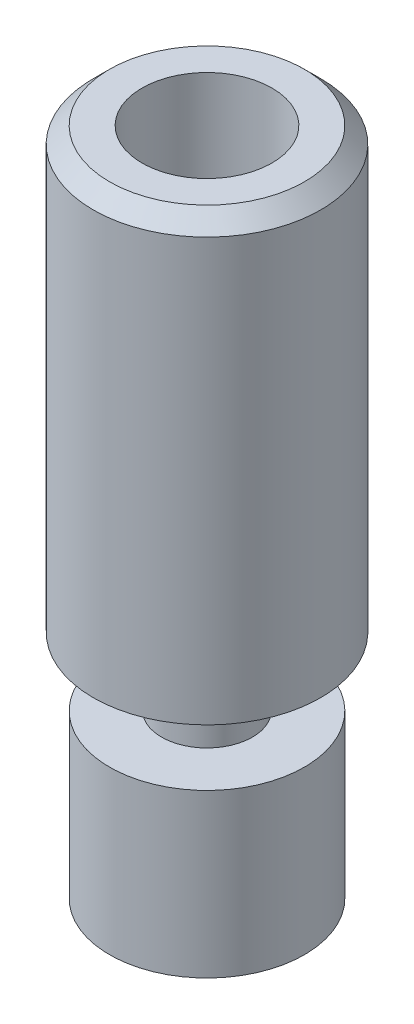
ISO-10303-21;
HEADER;
FILE_DESCRIPTION(('STEP AP214'),'2;1');
FILE_NAME('part.step','',(''),(''),'','','');
FILE_SCHEMA(('AUTOMOTIVE_DESIGN { 1 0 10303 214 1 1 1 1 }'));
ENDSEC;
DATA;
#1=APPLICATION_CONTEXT('core data for automotive mechanical design processes');
#2=APPLICATION_PROTOCOL_DEFINITION('international standard','automotive_design',2000,#1);
#3=PRODUCT_CONTEXT('',#1,'mechanical');
#4=PRODUCT('Part','Part','',(#3));
#5=PRODUCT_RELATED_PRODUCT_CATEGORY('part','',(#4));
#6=PRODUCT_DEFINITION_FORMATION('','',#4);
#7=PRODUCT_DEFINITION_CONTEXT('part definition',#1,'design');
#8=PRODUCT_DEFINITION('design','',#6,#7);
#9=PRODUCT_DEFINITION_SHAPE('','',#8);
#10=(LENGTH_UNIT() NAMED_UNIT(*) SI_UNIT(.MILLI.,.METRE.));
#11=(NAMED_UNIT(*) PLANE_ANGLE_UNIT() SI_UNIT($,.RADIAN.));
#12=(NAMED_UNIT(*) SI_UNIT($,.STERADIAN.) SOLID_ANGLE_UNIT());
#13=UNCERTAINTY_MEASURE_WITH_UNIT(LENGTH_MEASURE(1.E-05),#10,'distance_accuracy_value','');
#14=(GEOMETRIC_REPRESENTATION_CONTEXT(3) GLOBAL_UNCERTAINTY_ASSIGNED_CONTEXT((#13)) GLOBAL_UNIT_ASSIGNED_CONTEXT((#10,
#11,#12)) REPRESENTATION_CONTEXT('',''));
#15=CARTESIAN_POINT('',(0.,0.,0.));
#16=DIRECTION('',(0.,0.,1.));
#17=DIRECTION('',(1.,0.,0.));
#18=AXIS2_PLACEMENT_3D('',#15,#16,#17);
#19=CARTESIAN_POINT('',(0.,-10.3,0.));
#20=DIRECTION('',(0.,-1.,0.));
#21=DIRECTION('',(0.,0.,-1.));
#22=AXIS2_PLACEMENT_3D('',#19,#20,#21);
#23=CYLINDRICAL_SURFACE('',#22,3.);
#24=CARTESIAN_POINT('',(0.,-5.3,0.));
#25=DIRECTION('',(0.,-1.,0.));
#26=DIRECTION('',(0.,0.,-1.));
#27=AXIS2_PLACEMENT_3D('',#24,#25,#26);
#28=CIRCLE('',#27,3.);
#29=CARTESIAN_POINT('',(0.,-5.3,-3.));
#30=VERTEX_POINT('',#29);
#31=EDGE_CURVE('E41',#30,#30,#28,.T.);
#32=ORIENTED_EDGE('',*,*,#31,.T.);
#33=EDGE_LOOP('',(#32));
#34=FACE_BOUND('',#33,.T.);
#35=CARTESIAN_POINT('',(0.,-10.3,0.));
#36=DIRECTION('',(0.,-1.,0.));
#37=DIRECTION('',(0.,0.,-1.));
#38=AXIS2_PLACEMENT_3D('',#35,#36,#37);
#39=CIRCLE('',#38,3.);
#40=CARTESIAN_POINT('',(0.,-10.3,-3.));
#41=VERTEX_POINT('',#40);
#42=EDGE_CURVE('E68',#41,#41,#39,.T.);
#43=ORIENTED_EDGE('',*,*,#42,.F.);
#44=EDGE_LOOP('',(#43));
#45=FACE_BOUND('',#44,.T.);
#46=ADVANCED_FACE('F30',(#34,#45),#23,.T.);
#47=CARTESIAN_POINT('',(3.,-5.3,0.));
#48=DIRECTION('',(0.,1.,0.));
#49=DIRECTION('',(0.,0.,1.));
#50=AXIS2_PLACEMENT_3D('',#47,#48,#49);
#51=PLANE('',#50);
#52=CARTESIAN_POINT('',(0.,-5.3,0.));
#53=DIRECTION('',(0.,-1.,0.));
#54=DIRECTION('',(0.,0.,-1.));
#55=AXIS2_PLACEMENT_3D('',#52,#53,#54);
#56=CIRCLE('',#55,1.4);
#57=CARTESIAN_POINT('',(0.,-5.3,-1.4));
#58=VERTEX_POINT('',#57);
#59=EDGE_CURVE('E45',#58,#58,#56,.T.);
#60=ORIENTED_EDGE('',*,*,#59,.T.);
#61=EDGE_LOOP('',(#60));
#62=FACE_BOUND('',#61,.T.);
#63=ORIENTED_EDGE('',*,*,#31,.F.);
#64=EDGE_LOOP('',(#63));
#65=FACE_BOUND('',#64,.T.);
#66=ADVANCED_FACE('F76',(#62,#65),#51,.T.);
#67=CARTESIAN_POINT('',(0.,-10.3,0.));
#68=DIRECTION('',(0.,-1.,0.));
#69=DIRECTION('',(0.,0.,-1.));
#70=AXIS2_PLACEMENT_3D('',#67,#68,#69);
#71=CYLINDRICAL_SURFACE('',#70,1.4);
#72=CARTESIAN_POINT('',(0.,-3.2,0.));
#73=DIRECTION('',(0.,-1.,0.));
#74=DIRECTION('',(0.,0.,-1.));
#75=AXIS2_PLACEMENT_3D('',#72,#73,#74);
#76=CIRCLE('',#75,1.4);
#77=CARTESIAN_POINT('',(0.,-3.2,-1.4));
#78=VERTEX_POINT('',#77);
#79=EDGE_CURVE('E50',#78,#78,#76,.T.);
#80=ORIENTED_EDGE('',*,*,#79,.T.);
#81=EDGE_LOOP('',(#80));
#82=FACE_BOUND('',#81,.T.);
#83=ORIENTED_EDGE('',*,*,#59,.F.);
#84=EDGE_LOOP('',(#83));
#85=FACE_BOUND('',#84,.T.);
#86=ADVANCED_FACE('F81',(#82,#85),#71,.T.);
#87=CARTESIAN_POINT('',(1.4,-3.2,0.));
#88=DIRECTION('',(0.,-1.,0.));
#89=DIRECTION('',(0.,0.,-1.));
#90=AXIS2_PLACEMENT_3D('',#87,#88,#89);
#91=PLANE('',#90);
#92=CARTESIAN_POINT('',(0.,-3.2,0.));
#93=DIRECTION('',(0.,-1.,0.));
#94=DIRECTION('',(0.,0.,-1.));
#95=AXIS2_PLACEMENT_3D('',#92,#93,#94);
#96=CIRCLE('',#95,3.5);
#97=CARTESIAN_POINT('',(0.,-3.2,-3.5));
#98=VERTEX_POINT('',#97);
#99=EDGE_CURVE('E53',#98,#98,#96,.T.);
#100=ORIENTED_EDGE('',*,*,#99,.T.);
#101=EDGE_LOOP('',(#100));
#102=FACE_BOUND('',#101,.T.);
#103=ORIENTED_EDGE('',*,*,#79,.F.);
#104=EDGE_LOOP('',(#103));
#105=FACE_BOUND('',#104,.T.);
#106=ADVANCED_FACE('F87',(#102,#105),#91,.T.);
#107=CARTESIAN_POINT('',(0.,-10.3,0.));
#108=DIRECTION('',(0.,-1.,0.));
#109=DIRECTION('',(0.,0.,-1.));
#110=AXIS2_PLACEMENT_3D('',#107,#108,#109);
#111=CYLINDRICAL_SURFACE('',#110,3.5);
#112=CARTESIAN_POINT('',(0.,9.79999999999999,0.));
#113=DIRECTION('',(0.,1.,0.));
#114=DIRECTION('',(0.,0.,1.));
#115=AXIS2_PLACEMENT_3D('',#112,#113,#114);
#116=CIRCLE('',#115,3.5);
#117=CARTESIAN_POINT('',(0.,9.79999999999999,3.5));
#118=VERTEX_POINT('',#117);
#119=EDGE_CURVE('E37',#118,#118,#116,.F.);
#120=ORIENTED_EDGE('',*,*,#119,.T.);
#121=EDGE_LOOP('',(#120));
#122=FACE_BOUND('',#121,.T.);
#123=ORIENTED_EDGE('',*,*,#99,.F.);
#124=EDGE_LOOP('',(#123));
#125=FACE_BOUND('',#124,.T.);
#126=ADVANCED_FACE('F91',(#122,#125),#111,.T.);
#127=CARTESIAN_POINT('',(3.5,10.3,0.));
#128=DIRECTION('',(0.,1.,0.));
#129=DIRECTION('',(0.,0.,1.));
#130=AXIS2_PLACEMENT_3D('',#127,#128,#129);
#131=PLANE('',#130);
#132=CARTESIAN_POINT('',(0.,10.3,0.));
#133=DIRECTION('',(0.,1.,0.));
#134=DIRECTION('',(0.,0.,1.));
#135=AXIS2_PLACEMENT_3D('',#132,#133,#134);
#136=CIRCLE('',#135,2.99999999999999);
#137=CARTESIAN_POINT('',(0.,10.3,2.99999999999999));
#138=VERTEX_POINT('',#137);
#139=EDGE_CURVE('E10',#138,#138,#136,.T.);
#140=ORIENTED_EDGE('',*,*,#139,.T.);
#141=EDGE_LOOP('',(#140));
#142=FACE_BOUND('',#141,.T.);
#143=CARTESIAN_POINT('',(0.,10.3,0.));
#144=DIRECTION('',(0.,-1.,0.));
#145=DIRECTION('',(0.,0.,-1.));
#146=AXIS2_PLACEMENT_3D('',#143,#144,#145);
#147=CIRCLE('',#146,2.);
#148=CARTESIAN_POINT('',(0.,10.3,-2.));
#149=VERTEX_POINT('',#148);
#150=EDGE_CURVE('E56',#149,#149,#147,.T.);
#151=ORIENTED_EDGE('',*,*,#150,.T.);
#152=EDGE_LOOP('',(#151));
#153=FACE_BOUND('',#152,.T.);
#154=ADVANCED_FACE('F95',(#142,#153),#131,.T.);
#155=CARTESIAN_POINT('',(0.,-10.3,0.));
#156=DIRECTION('',(0.,-1.,0.));
#157=DIRECTION('',(0.,0.,-1.));
#158=AXIS2_PLACEMENT_3D('',#155,#156,#157);
#159=CYLINDRICAL_SURFACE('',#158,2.);
#160=CARTESIAN_POINT('',(0.,6.3,0.));
#161=DIRECTION('',(0.,-1.,0.));
#162=DIRECTION('',(0.,0.,-1.));
#163=AXIS2_PLACEMENT_3D('',#160,#161,#162);
#164=CIRCLE('',#163,2.);
#165=CARTESIAN_POINT('',(0.,6.3,-2.));
#166=VERTEX_POINT('',#165);
#167=EDGE_CURVE('E59',#166,#166,#164,.T.);
#168=ORIENTED_EDGE('',*,*,#167,.T.);
#169=EDGE_LOOP('',(#168));
#170=FACE_BOUND('',#169,.T.);
#171=ORIENTED_EDGE('',*,*,#150,.F.);
#172=EDGE_LOOP('',(#171));
#173=FACE_BOUND('',#172,.T.);
#174=ADVANCED_FACE('F98',(#170,#173),#159,.F.);
#175=CARTESIAN_POINT('',(0.,6.3,0.));
#176=DIRECTION('',(0.,1.,0.));
#177=DIRECTION('',(0.,0.,1.));
#178=AXIS2_PLACEMENT_3D('',#175,#176,#177);
#179=CONICAL_SURFACE('',#178,2.,1.0471975511966);
#180=CARTESIAN_POINT('',(0.,5.72264973081038,0.));
#181=DIRECTION('',(0.,-1.,0.));
#182=DIRECTION('',(0.,0.,-1.));
#183=AXIS2_PLACEMENT_3D('',#180,#181,#182);
#184=CIRCLE('',#183,1.);
#185=CARTESIAN_POINT('',(0.,5.72264973081038,-1.));
#186=VERTEX_POINT('',#185);
#187=EDGE_CURVE('E62',#186,#186,#184,.T.);
#188=ORIENTED_EDGE('',*,*,#187,.T.);
#189=EDGE_LOOP('',(#188));
#190=FACE_BOUND('',#189,.T.);
#191=ORIENTED_EDGE('',*,*,#167,.F.);
#192=EDGE_LOOP('',(#191));
#193=FACE_BOUND('',#192,.T.);
#194=ADVANCED_FACE('F101',(#190,#193),#179,.F.);
#195=CARTESIAN_POINT('',(0.,-10.3,0.));
#196=DIRECTION('',(0.,-1.,0.));
#197=DIRECTION('',(0.,0.,-1.));
#198=AXIS2_PLACEMENT_3D('',#195,#196,#197);
#199=CYLINDRICAL_SURFACE('',#198,1.);
#200=CARTESIAN_POINT('',(0.,-10.3,0.));
#201=DIRECTION('',(0.,-1.,0.));
#202=DIRECTION('',(0.,0.,-1.));
#203=AXIS2_PLACEMENT_3D('',#200,#201,#202);
#204=CIRCLE('',#203,1.);
#205=CARTESIAN_POINT('',(0.,-10.3,-1.));
#206=VERTEX_POINT('',#205);
#207=EDGE_CURVE('E65',#206,#206,#204,.T.);
#208=ORIENTED_EDGE('',*,*,#207,.T.);
#209=EDGE_LOOP('',(#208));
#210=FACE_BOUND('',#209,.T.);
#211=ORIENTED_EDGE('',*,*,#187,.F.);
#212=EDGE_LOOP('',(#211));
#213=FACE_BOUND('',#212,.T.);
#214=ADVANCED_FACE('F105',(#210,#213),#199,.F.);
#215=CARTESIAN_POINT('',(1.,-10.3,0.));
#216=DIRECTION('',(0.,-1.,0.));
#217=DIRECTION('',(0.,0.,-1.));
#218=AXIS2_PLACEMENT_3D('',#215,#216,#217);
#219=PLANE('',#218);
#220=ORIENTED_EDGE('',*,*,#42,.T.);
#221=EDGE_LOOP('',(#220));
#222=FACE_BOUND('',#221,.T.);
#223=ORIENTED_EDGE('',*,*,#207,.F.);
#224=EDGE_LOOP('',(#223));
#225=FACE_BOUND('',#224,.T.);
#226=ADVANCED_FACE('F72',(#222,#225),#219,.T.);
#227=CARTESIAN_POINT('',(0.,9.79999999999999,0.));
#228=DIRECTION('',(0.,-1.,0.));
#229=DIRECTION('',(0.,0.,-1.));
#230=AXIS2_PLACEMENT_3D('',#227,#228,#229);
#231=CONICAL_SURFACE('',#230,3.5,0.785398163397449);
#232=ORIENTED_EDGE('',*,*,#139,.F.);
#233=EDGE_LOOP('',(#232));
#234=FACE_BOUND('',#233,.T.);
#235=ORIENTED_EDGE('',*,*,#119,.F.);
#236=EDGE_LOOP('',(#235));
#237=FACE_BOUND('',#236,.T.);
#238=ADVANCED_FACE('F32',(#234,#237),#231,.T.);
#239=CLOSED_SHELL('',(#46,#66,#86,#106,#126,#154,#174,#194,#214,#226,#238));
#240=MANIFOLD_SOLID_BREP('B2',#239);
#241=ADVANCED_BREP_SHAPE_REPRESENTATION('',(#18,#240),#14);
#242=SHAPE_DEFINITION_REPRESENTATION(#9,#241);
ENDSEC;
END-ISO-10303-21;
